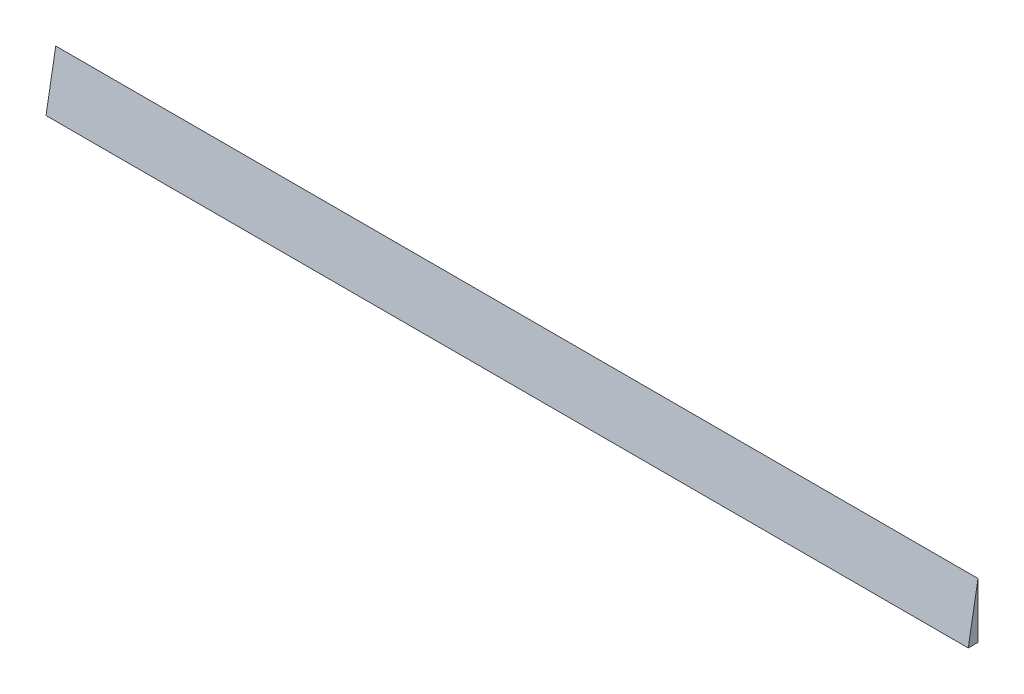
ISO-10303-21;
HEADER;
FILE_DESCRIPTION(('STEP AP214'),'2;1');
FILE_NAME('part.step','',(''),(''),'','','');
FILE_SCHEMA(('AUTOMOTIVE_DESIGN { 1 0 10303 214 1 1 1 1 }'));
ENDSEC;
DATA;
#1=APPLICATION_CONTEXT('core data for automotive mechanical design processes');
#2=APPLICATION_PROTOCOL_DEFINITION('international standard','automotive_design',2000,#1);
#3=PRODUCT_CONTEXT('',#1,'mechanical');
#4=PRODUCT('Part','Part','',(#3));
#5=PRODUCT_RELATED_PRODUCT_CATEGORY('part','',(#4));
#6=PRODUCT_DEFINITION_FORMATION('','',#4);
#7=PRODUCT_DEFINITION_CONTEXT('part definition',#1,'design');
#8=PRODUCT_DEFINITION('design','',#6,#7);
#9=PRODUCT_DEFINITION_SHAPE('','',#8);
#10=(LENGTH_UNIT() NAMED_UNIT(*) SI_UNIT(.MILLI.,.METRE.));
#11=(NAMED_UNIT(*) PLANE_ANGLE_UNIT() SI_UNIT($,.RADIAN.));
#12=(NAMED_UNIT(*) SI_UNIT($,.STERADIAN.) SOLID_ANGLE_UNIT());
#13=UNCERTAINTY_MEASURE_WITH_UNIT(LENGTH_MEASURE(1.E-05),#10,'distance_accuracy_value','');
#14=(GEOMETRIC_REPRESENTATION_CONTEXT(3) GLOBAL_UNCERTAINTY_ASSIGNED_CONTEXT((#13)) GLOBAL_UNIT_ASSIGNED_CONTEXT((#10,
#11,#12)) REPRESENTATION_CONTEXT('',''));
#15=CARTESIAN_POINT('',(0.,0.,0.));
#16=DIRECTION('',(0.,0.,1.));
#17=DIRECTION('',(1.,0.,0.));
#18=AXIS2_PLACEMENT_3D('',#15,#16,#17);
#19=CARTESIAN_POINT('',(400.,0.,4.23184753700326));
#20=DIRECTION('',(0.,1.,0.));
#21=DIRECTION('',(0.,0.,1.));
#22=AXIS2_PLACEMENT_3D('',#19,#20,#21);
#23=PLANE('',#22);
#24=DIRECTION('',(0.,0.,-1.));
#25=VECTOR('',#24,1.);
#26=CARTESIAN_POINT('',(0.,0.,4.23184753700326));
#27=LINE('',#26,#25);
#28=CARTESIAN_POINT('',(0.,0.,4.23184753700326));
#29=VERTEX_POINT('',#28);
#30=CARTESIAN_POINT('',(0.,0.,0.));
#31=VERTEX_POINT('',#30);
#32=EDGE_CURVE('E95',#29,#31,#27,.T.);
#33=ORIENTED_EDGE('',*,*,#32,.T.);
#34=DIRECTION('',(-1.,0.,0.));
#35=VECTOR('',#34,1.);
#36=CARTESIAN_POINT('',(400.,0.,0.));
#37=LINE('',#36,#35);
#38=CARTESIAN_POINT('',(400.,0.,0.));
#39=VERTEX_POINT('',#38);
#40=EDGE_CURVE('E11',#39,#31,#37,.T.);
#41=ORIENTED_EDGE('',*,*,#40,.F.);
#42=DIRECTION('',(0.,0.,-1.));
#43=VECTOR('',#42,1.);
#44=CARTESIAN_POINT('',(400.,0.,4.23184753700326));
#45=LINE('',#44,#43);
#46=CARTESIAN_POINT('',(400.,0.,4.23184753700326));
#47=VERTEX_POINT('',#46);
#48=EDGE_CURVE('E87',#47,#39,#45,.T.);
#49=ORIENTED_EDGE('',*,*,#48,.F.);
#50=DIRECTION('',(-1.,0.,0.));
#51=VECTOR('',#50,1.);
#52=CARTESIAN_POINT('',(400.,0.,4.23184753700326));
#53=LINE('',#52,#51);
#54=EDGE_CURVE('E96',#47,#29,#53,.T.);
#55=ORIENTED_EDGE('',*,*,#54,.T.);
#56=EDGE_LOOP('',(#33,#41,#49,#55));
#57=FACE_BOUND('',#56,.T.);
#58=ADVANCED_FACE('F45',(#57),#23,.F.);
#59=CARTESIAN_POINT('',(400.,0.,0.));
#60=DIRECTION('',(0.,0.,1.));
#61=DIRECTION('',(1.,0.,0.));
#62=AXIS2_PLACEMENT_3D('',#59,#60,#61);
#63=PLANE('',#62);
#64=DIRECTION('',(0.,1.,0.));
#65=VECTOR('',#64,1.);
#66=CARTESIAN_POINT('',(0.,0.,0.));
#67=LINE('',#66,#65);
#68=CARTESIAN_POINT('',(0.,24.,0.));
#69=VERTEX_POINT('',#68);
#70=EDGE_CURVE('E74',#31,#69,#67,.T.);
#71=ORIENTED_EDGE('',*,*,#70,.T.);
#72=DIRECTION('',(-1.,0.,0.));
#73=VECTOR('',#72,1.);
#74=CARTESIAN_POINT('',(400.,24.,0.));
#75=LINE('',#74,#73);
#76=CARTESIAN_POINT('',(400.,24.,0.));
#77=VERTEX_POINT('',#76);
#78=EDGE_CURVE('E54',#77,#69,#75,.T.);
#79=ORIENTED_EDGE('',*,*,#78,.F.);
#80=DIRECTION('',(0.,1.,0.));
#81=VECTOR('',#80,1.);
#82=CARTESIAN_POINT('',(400.,0.,0.));
#83=LINE('',#82,#81);
#84=EDGE_CURVE('E82',#39,#77,#83,.T.);
#85=ORIENTED_EDGE('',*,*,#84,.F.);
#86=ORIENTED_EDGE('',*,*,#40,.T.);
#87=EDGE_LOOP('',(#71,#79,#85,#86));
#88=FACE_BOUND('',#87,.T.);
#89=ADVANCED_FACE('F83',(#88),#63,.F.);
#90=CARTESIAN_POINT('',(400.,24.,0.));
#91=DIRECTION('',(0.,-0.173648177666934,-0.984807753012207));
#92=DIRECTION('',(0.,0.984807753012207,-0.173648177666934));
#93=AXIS2_PLACEMENT_3D('',#90,#91,#92);
#94=PLANE('',#93);
#95=DIRECTION('',(0.,-0.984807753012207,0.173648177666934));
#96=VECTOR('',#95,1.);
#97=CARTESIAN_POINT('',(0.,24.,0.));
#98=LINE('',#97,#96);
#99=EDGE_CURVE('E79',#69,#29,#98,.T.);
#100=ORIENTED_EDGE('',*,*,#99,.T.);
#101=ORIENTED_EDGE('',*,*,#54,.F.);
#102=DIRECTION('',(0.,-0.984807753012207,0.173648177666934));
#103=VECTOR('',#102,1.);
#104=CARTESIAN_POINT('',(400.,24.,0.));
#105=LINE('',#104,#103);
#106=EDGE_CURVE('E62',#77,#47,#105,.T.);
#107=ORIENTED_EDGE('',*,*,#106,.F.);
#108=ORIENTED_EDGE('',*,*,#78,.T.);
#109=EDGE_LOOP('',(#100,#101,#107,#108));
#110=FACE_BOUND('',#109,.T.);
#111=ADVANCED_FACE('F108',(#110),#94,.F.);
#112=CARTESIAN_POINT('',(400.,0.,0.));
#113=DIRECTION('',(1.,0.,0.));
#114=DIRECTION('',(0.,0.,-1.));
#115=AXIS2_PLACEMENT_3D('',#112,#113,#114);
#116=PLANE('',#115);
#117=ORIENTED_EDGE('',*,*,#48,.T.);
#118=ORIENTED_EDGE('',*,*,#84,.T.);
#119=ORIENTED_EDGE('',*,*,#106,.T.);
#120=EDGE_LOOP('',(#117,#118,#119));
#121=FACE_BOUND('',#120,.T.);
#122=ADVANCED_FACE('F90',(#121),#116,.T.);
#123=CARTESIAN_POINT('',(0.,0.,0.));
#124=DIRECTION('',(1.,0.,0.));
#125=DIRECTION('',(0.,0.,-1.));
#126=AXIS2_PLACEMENT_3D('',#123,#124,#125);
#127=PLANE('',#126);
#128=ORIENTED_EDGE('',*,*,#32,.F.);
#129=ORIENTED_EDGE('',*,*,#99,.F.);
#130=ORIENTED_EDGE('',*,*,#70,.F.);
#131=EDGE_LOOP('',(#128,#129,#130));
#132=FACE_BOUND('',#131,.T.);
#133=ADVANCED_FACE('F109',(#132),#127,.F.);
#134=CLOSED_SHELL('',(#58,#89,#111,#122,#133));
#135=MANIFOLD_SOLID_BREP('B2',#134);
#136=ADVANCED_BREP_SHAPE_REPRESENTATION('',(#18,#135),#14);
#137=SHAPE_DEFINITION_REPRESENTATION(#9,#136);
ENDSEC;
END-ISO-10303-21;
